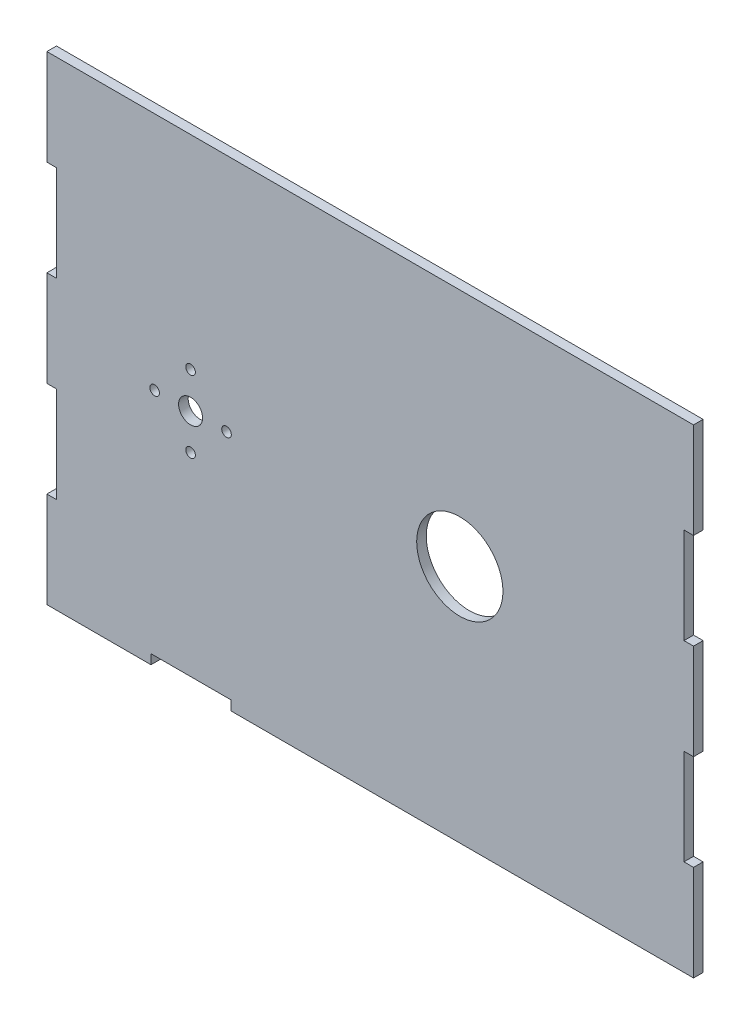
ISO-10303-21;
HEADER;
FILE_DESCRIPTION(('STEP AP214'),'2;1');
FILE_NAME('part.step','',(''),(''),'','','');
FILE_SCHEMA(('AUTOMOTIVE_DESIGN { 1 0 10303 214 1 1 1 1 }'));
ENDSEC;
DATA;
#1=APPLICATION_CONTEXT('core data for automotive mechanical design processes');
#2=APPLICATION_PROTOCOL_DEFINITION('international standard','automotive_design',2000,#1);
#3=PRODUCT_CONTEXT('',#1,'mechanical');
#4=PRODUCT('Part','Part','',(#3));
#5=PRODUCT_RELATED_PRODUCT_CATEGORY('part','',(#4));
#6=PRODUCT_DEFINITION_FORMATION('','',#4);
#7=PRODUCT_DEFINITION_CONTEXT('part definition',#1,'design');
#8=PRODUCT_DEFINITION('design','',#6,#7);
#9=PRODUCT_DEFINITION_SHAPE('','',#8);
#10=(LENGTH_UNIT() NAMED_UNIT(*) SI_UNIT(.MILLI.,.METRE.));
#11=(NAMED_UNIT(*) PLANE_ANGLE_UNIT() SI_UNIT($,.RADIAN.));
#12=(NAMED_UNIT(*) SI_UNIT($,.STERADIAN.) SOLID_ANGLE_UNIT());
#13=UNCERTAINTY_MEASURE_WITH_UNIT(LENGTH_MEASURE(1.E-05),#10,'distance_accuracy_value','');
#14=(GEOMETRIC_REPRESENTATION_CONTEXT(3) GLOBAL_UNCERTAINTY_ASSIGNED_CONTEXT((#13)) GLOBAL_UNIT_ASSIGNED_CONTEXT((#10,
#11,#12)) REPRESENTATION_CONTEXT('',''));
#15=CARTESIAN_POINT('',(0.,0.,0.));
#16=DIRECTION('',(0.,0.,1.));
#17=DIRECTION('',(1.,0.,0.));
#18=AXIS2_PLACEMENT_3D('',#15,#16,#17);
#19=CARTESIAN_POINT('',(0.,0.,2.54));
#20=DIRECTION('',(0.,1.,0.));
#21=DIRECTION('',(0.,0.,1.));
#22=AXIS2_PLACEMENT_3D('',#19,#20,#21);
#23=PLANE('',#22);
#24=DIRECTION('',(1.,0.,0.));
#25=VECTOR('',#24,1.);
#26=CARTESIAN_POINT('',(0.,0.,2.54));
#27=LINE('',#26,#25);
#28=CARTESIAN_POINT('',(48.768,0.,2.54));
#29=VERTEX_POINT('',#28);
#30=CARTESIAN_POINT('',(171.45,0.,2.54));
#31=VERTEX_POINT('',#30);
#32=EDGE_CURVE('E224',#29,#31,#27,.T.);
#33=ORIENTED_EDGE('',*,*,#32,.F.);
#34=DIRECTION('',(0.,0.,-1.));
#35=VECTOR('',#34,1.);
#36=CARTESIAN_POINT('',(48.768,0.,2.54));
#37=LINE('',#36,#35);
#38=CARTESIAN_POINT('',(48.768,0.,0.));
#39=VERTEX_POINT('',#38);
#40=EDGE_CURVE('E208',#29,#39,#37,.T.);
#41=ORIENTED_EDGE('',*,*,#40,.T.);
#42=DIRECTION('',(1.,0.,0.));
#43=VECTOR('',#42,1.);
#44=CARTESIAN_POINT('',(0.,0.,0.));
#45=LINE('',#44,#43);
#46=CARTESIAN_POINT('',(171.45,0.,0.));
#47=VERTEX_POINT('',#46);
#48=EDGE_CURVE('E260',#39,#47,#45,.T.);
#49=ORIENTED_EDGE('',*,*,#48,.T.);
#50=DIRECTION('',(0.,0.,-1.));
#51=VECTOR('',#50,1.);
#52=CARTESIAN_POINT('',(171.45,0.,2.54));
#53=LINE('',#52,#51);
#54=EDGE_CURVE('E54',#31,#47,#53,.T.);
#55=ORIENTED_EDGE('',*,*,#54,.F.);
#56=EDGE_LOOP('',(#33,#41,#49,#55));
#57=FACE_BOUND('',#56,.T.);
#58=ADVANCED_FACE('F45',(#57),#23,.F.);
#59=CARTESIAN_POINT('',(171.45,0.,2.54));
#60=DIRECTION('',(-1.,0.,0.));
#61=DIRECTION('',(0.,-1.,0.));
#62=AXIS2_PLACEMENT_3D('',#59,#60,#61);
#63=PLANE('',#62);
#64=DIRECTION('',(0.,1.,0.));
#65=VECTOR('',#64,1.);
#66=CARTESIAN_POINT('',(171.45,0.,0.));
#67=LINE('',#66,#65);
#68=CARTESIAN_POINT('',(171.45,25.4,0.));
#69=VERTEX_POINT('',#68);
#70=EDGE_CURVE('E268',#47,#69,#67,.T.);
#71=ORIENTED_EDGE('',*,*,#70,.T.);
#72=DIRECTION('',(0.,0.,1.));
#73=VECTOR('',#72,1.);
#74=CARTESIAN_POINT('',(171.45,25.4,0.));
#75=LINE('',#74,#73);
#76=CARTESIAN_POINT('',(171.45,25.4,2.54));
#77=VERTEX_POINT('',#76);
#78=EDGE_CURVE('E317',#69,#77,#75,.T.);
#79=ORIENTED_EDGE('',*,*,#78,.T.);
#80=DIRECTION('',(0.,1.,0.));
#81=VECTOR('',#80,1.);
#82=CARTESIAN_POINT('',(171.45,0.,2.54));
#83=LINE('',#82,#81);
#84=EDGE_CURVE('E248',#31,#77,#83,.T.);
#85=ORIENTED_EDGE('',*,*,#84,.F.);
#86=ORIENTED_EDGE('',*,*,#54,.T.);
#87=EDGE_LOOP('',(#71,#79,#85,#86));
#88=FACE_BOUND('',#87,.T.);
#89=ADVANCED_FACE('F285',(#88),#63,.F.);
#90=CARTESIAN_POINT('',(171.45,50.8,2.54));
#91=VERTEX_POINT('',#90);
#92=CARTESIAN_POINT('',(171.45,76.2,2.54));
#93=VERTEX_POINT('',#92);
#94=EDGE_CURVE('E252',#91,#93,#83,.T.);
#95=ORIENTED_EDGE('',*,*,#94,.F.);
#96=DIRECTION('',(0.,0.,1.));
#97=VECTOR('',#96,1.);
#98=CARTESIAN_POINT('',(171.45,50.8,0.));
#99=LINE('',#98,#97);
#100=CARTESIAN_POINT('',(171.45,50.8,0.));
#101=VERTEX_POINT('',#100);
#102=EDGE_CURVE('E295',#101,#91,#99,.T.);
#103=ORIENTED_EDGE('',*,*,#102,.F.);
#104=CARTESIAN_POINT('',(171.45,76.2,0.));
#105=VERTEX_POINT('',#104);
#106=EDGE_CURVE('E273',#101,#105,#67,.T.);
#107=ORIENTED_EDGE('',*,*,#106,.T.);
#108=DIRECTION('',(0.,0.,1.));
#109=VECTOR('',#108,1.);
#110=CARTESIAN_POINT('',(171.45,76.2,0.));
#111=LINE('',#110,#109);
#112=EDGE_CURVE('E350',#105,#93,#111,.T.);
#113=ORIENTED_EDGE('',*,*,#112,.T.);
#114=EDGE_LOOP('',(#95,#103,#107,#113));
#115=FACE_BOUND('',#114,.T.);
#116=ADVANCED_FACE('F486',(#115),#63,.F.);
#117=CARTESIAN_POINT('',(0.,0.,2.54));
#118=DIRECTION('',(1.,0.,0.));
#119=DIRECTION('',(0.,1.,0.));
#120=AXIS2_PLACEMENT_3D('',#117,#118,#119);
#121=PLANE('',#120);
#122=DIRECTION('',(0.,-1.,0.));
#123=VECTOR('',#122,1.);
#124=CARTESIAN_POINT('',(0.,0.,0.));
#125=LINE('',#124,#123);
#126=CARTESIAN_POINT('',(0.,76.2,0.));
#127=VERTEX_POINT('',#126);
#128=CARTESIAN_POINT('',(0.,50.8,0.));
#129=VERTEX_POINT('',#128);
#130=EDGE_CURVE('E261',#127,#129,#125,.T.);
#131=ORIENTED_EDGE('',*,*,#130,.T.);
#132=DIRECTION('',(0.,0.,1.));
#133=VECTOR('',#132,1.);
#134=CARTESIAN_POINT('',(0.,50.8,0.));
#135=LINE('',#134,#133);
#136=CARTESIAN_POINT('',(0.,50.8,2.54));
#137=VERTEX_POINT('',#136);
#138=EDGE_CURVE('E386',#129,#137,#135,.T.);
#139=ORIENTED_EDGE('',*,*,#138,.T.);
#140=DIRECTION('',(0.,-1.,0.));
#141=VECTOR('',#140,1.);
#142=CARTESIAN_POINT('',(0.,0.,2.54));
#143=LINE('',#142,#141);
#144=CARTESIAN_POINT('',(0.,76.2,2.54));
#145=VERTEX_POINT('',#144);
#146=EDGE_CURVE('E243',#145,#137,#143,.T.);
#147=ORIENTED_EDGE('',*,*,#146,.F.);
#148=DIRECTION('',(0.,0.,1.));
#149=VECTOR('',#148,1.);
#150=CARTESIAN_POINT('',(0.,76.2,0.));
#151=LINE('',#150,#149);
#152=EDGE_CURVE('E412',#127,#145,#151,.T.);
#153=ORIENTED_EDGE('',*,*,#152,.F.);
#154=EDGE_LOOP('',(#131,#139,#147,#153));
#155=FACE_BOUND('',#154,.T.);
#156=ADVANCED_FACE('F445',(#155),#121,.F.);
#157=CARTESIAN_POINT('',(0.,127.,0.));
#158=VERTEX_POINT('',#157);
#159=CARTESIAN_POINT('',(0.,101.6,0.));
#160=VERTEX_POINT('',#159);
#161=EDGE_CURVE('E256',#158,#160,#125,.T.);
#162=ORIENTED_EDGE('',*,*,#161,.T.);
#163=DIRECTION('',(0.,0.,1.));
#164=VECTOR('',#163,1.);
#165=CARTESIAN_POINT('',(0.,101.6,0.));
#166=LINE('',#165,#164);
#167=CARTESIAN_POINT('',(0.,101.6,2.54));
#168=VERTEX_POINT('',#167);
#169=EDGE_CURVE('E422',#160,#168,#166,.T.);
#170=ORIENTED_EDGE('',*,*,#169,.T.);
#171=CARTESIAN_POINT('',(0.,127.,2.54));
#172=VERTEX_POINT('',#171);
#173=EDGE_CURVE('E236',#172,#168,#143,.T.);
#174=ORIENTED_EDGE('',*,*,#173,.F.);
#175=DIRECTION('',(0.,0.,-1.));
#176=VECTOR('',#175,1.);
#177=CARTESIAN_POINT('',(0.,127.,2.54));
#178=LINE('',#177,#176);
#179=EDGE_CURVE('E255',#172,#158,#178,.T.);
#180=ORIENTED_EDGE('',*,*,#179,.T.);
#181=EDGE_LOOP('',(#162,#170,#174,#180));
#182=FACE_BOUND('',#181,.T.);
#183=ADVANCED_FACE('F507',(#182),#121,.F.);
#184=CARTESIAN_POINT('',(0.,25.4,2.54));
#185=VERTEX_POINT('',#184);
#186=CARTESIAN_POINT('',(0.,0.,2.54));
#187=VERTEX_POINT('',#186);
#188=EDGE_CURVE('E245',#185,#187,#143,.T.);
#189=ORIENTED_EDGE('',*,*,#188,.F.);
#190=DIRECTION('',(0.,0.,1.));
#191=VECTOR('',#190,1.);
#192=CARTESIAN_POINT('',(0.,25.4,0.));
#193=LINE('',#192,#191);
#194=CARTESIAN_POINT('',(0.,25.4,0.));
#195=VERTEX_POINT('',#194);
#196=EDGE_CURVE('E376',#195,#185,#193,.T.);
#197=ORIENTED_EDGE('',*,*,#196,.F.);
#198=CARTESIAN_POINT('',(0.,0.,0.));
#199=VERTEX_POINT('',#198);
#200=EDGE_CURVE('E262',#195,#199,#125,.T.);
#201=ORIENTED_EDGE('',*,*,#200,.T.);
#202=DIRECTION('',(0.,0.,-1.));
#203=VECTOR('',#202,1.);
#204=CARTESIAN_POINT('',(0.,0.,2.54));
#205=LINE('',#204,#203);
#206=EDGE_CURVE('E11',#187,#199,#205,.T.);
#207=ORIENTED_EDGE('',*,*,#206,.F.);
#208=EDGE_LOOP('',(#189,#197,#201,#207));
#209=FACE_BOUND('',#208,.T.);
#210=ADVANCED_FACE('F47',(#209),#121,.F.);
#211=CARTESIAN_POINT('',(27.6013333333333,0.,0.));
#212=VERTEX_POINT('',#211);
#213=EDGE_CURVE('E263',#199,#212,#45,.T.);
#214=ORIENTED_EDGE('',*,*,#213,.T.);
#215=DIRECTION('',(0.,0.,-1.));
#216=VECTOR('',#215,1.);
#217=CARTESIAN_POINT('',(27.6013333333333,0.,2.54));
#218=LINE('',#217,#216);
#219=CARTESIAN_POINT('',(27.6013333333333,0.,2.54));
#220=VERTEX_POINT('',#219);
#221=EDGE_CURVE('E61',#220,#212,#218,.T.);
#222=ORIENTED_EDGE('',*,*,#221,.F.);
#223=EDGE_CURVE('E235',#187,#220,#27,.T.);
#224=ORIENTED_EDGE('',*,*,#223,.F.);
#225=ORIENTED_EDGE('',*,*,#206,.T.);
#226=EDGE_LOOP('',(#214,#222,#224,#225));
#227=FACE_BOUND('',#226,.T.);
#228=ADVANCED_FACE('F456',(#227),#23,.F.);
#229=CARTESIAN_POINT('',(171.45,101.6,2.54));
#230=VERTEX_POINT('',#229);
#231=CARTESIAN_POINT('',(171.45,127.,2.54));
#232=VERTEX_POINT('',#231);
#233=EDGE_CURVE('E241',#230,#232,#83,.T.);
#234=ORIENTED_EDGE('',*,*,#233,.F.);
#235=DIRECTION('',(0.,0.,1.));
#236=VECTOR('',#235,1.);
#237=CARTESIAN_POINT('',(171.45,101.6,0.));
#238=LINE('',#237,#236);
#239=CARTESIAN_POINT('',(171.45,101.6,0.));
#240=VERTEX_POINT('',#239);
#241=EDGE_CURVE('E339',#240,#230,#238,.T.);
#242=ORIENTED_EDGE('',*,*,#241,.F.);
#243=CARTESIAN_POINT('',(171.45,127.,0.));
#244=VERTEX_POINT('',#243);
#245=EDGE_CURVE('E267',#240,#244,#67,.T.);
#246=ORIENTED_EDGE('',*,*,#245,.T.);
#247=DIRECTION('',(0.,0.,-1.));
#248=VECTOR('',#247,1.);
#249=CARTESIAN_POINT('',(171.45,127.,2.54));
#250=LINE('',#249,#248);
#251=EDGE_CURVE('E279',#232,#244,#250,.T.);
#252=ORIENTED_EDGE('',*,*,#251,.F.);
#253=EDGE_LOOP('',(#234,#242,#246,#252));
#254=FACE_BOUND('',#253,.T.);
#255=ADVANCED_FACE('F499',(#254),#63,.F.);
#256=CARTESIAN_POINT('',(0.,127.,2.54));
#257=DIRECTION('',(0.,-1.,0.));
#258=DIRECTION('',(0.,0.,-1.));
#259=AXIS2_PLACEMENT_3D('',#256,#257,#258);
#260=PLANE('',#259);
#261=DIRECTION('',(-1.,0.,0.));
#262=VECTOR('',#261,1.);
#263=CARTESIAN_POINT('',(0.,127.,0.));
#264=LINE('',#263,#262);
#265=EDGE_CURVE('E272',#244,#158,#264,.T.);
#266=ORIENTED_EDGE('',*,*,#265,.T.);
#267=ORIENTED_EDGE('',*,*,#179,.F.);
#268=DIRECTION('',(-1.,0.,0.));
#269=VECTOR('',#268,1.);
#270=CARTESIAN_POINT('',(0.,127.,2.54));
#271=LINE('',#270,#269);
#272=EDGE_CURVE('E251',#232,#172,#271,.T.);
#273=ORIENTED_EDGE('',*,*,#272,.F.);
#274=ORIENTED_EDGE('',*,*,#251,.T.);
#275=EDGE_LOOP('',(#266,#267,#273,#274));
#276=FACE_BOUND('',#275,.T.);
#277=ADVANCED_FACE('F503',(#276),#260,.F.);
#278=CARTESIAN_POINT('',(0.,0.,2.54));
#279=DIRECTION('',(0.,0.,-1.));
#280=DIRECTION('',(-1.,0.,0.));
#281=AXIS2_PLACEMENT_3D('',#278,#279,#280);
#282=PLANE('',#281);
#283=CARTESIAN_POINT('',(47.625,63.5,2.54));
#284=DIRECTION('',(0.,0.,-1.));
#285=DIRECTION('',(0.,1.,0.));
#286=AXIS2_PLACEMENT_3D('',#283,#284,#285);
#287=CIRCLE('',#286,1.27);
#288=CARTESIAN_POINT('',(47.625,64.77,2.54));
#289=VERTEX_POINT('',#288);
#290=EDGE_CURVE('E809',#289,#289,#287,.T.);
#291=ORIENTED_EDGE('',*,*,#290,.T.);
#292=EDGE_LOOP('',(#291));
#293=FACE_BOUND('',#292,.T.);
#294=CARTESIAN_POINT('',(38.1,53.975,2.54));
#295=DIRECTION('',(0.,0.,-1.));
#296=DIRECTION('',(1.,0.,0.));
#297=AXIS2_PLACEMENT_3D('',#294,#295,#296);
#298=CIRCLE('',#297,1.27);
#299=CARTESIAN_POINT('',(39.37,53.975,2.54));
#300=VERTEX_POINT('',#299);
#301=EDGE_CURVE('E814',#300,#300,#298,.T.);
#302=ORIENTED_EDGE('',*,*,#301,.T.);
#303=EDGE_LOOP('',(#302));
#304=FACE_BOUND('',#303,.T.);
#305=CARTESIAN_POINT('',(28.575,63.5000000000001,2.54));
#306=DIRECTION('',(0.,0.,-1.));
#307=DIRECTION('',(0.,-1.,0.));
#308=AXIS2_PLACEMENT_3D('',#305,#306,#307);
#309=CIRCLE('',#308,1.27);
#310=CARTESIAN_POINT('',(28.575,62.2300000000001,2.54));
#311=VERTEX_POINT('',#310);
#312=EDGE_CURVE('E827',#311,#311,#309,.T.);
#313=ORIENTED_EDGE('',*,*,#312,.T.);
#314=EDGE_LOOP('',(#313));
#315=FACE_BOUND('',#314,.T.);
#316=CARTESIAN_POINT('',(38.1,73.025,2.54));
#317=DIRECTION('',(0.,0.,-1.));
#318=DIRECTION('',(-1.,0.,0.));
#319=AXIS2_PLACEMENT_3D('',#316,#317,#318);
#320=CIRCLE('',#319,1.27);
#321=CARTESIAN_POINT('',(36.83,73.025,2.54));
#322=VERTEX_POINT('',#321);
#323=EDGE_CURVE('E835',#322,#322,#320,.T.);
#324=ORIENTED_EDGE('',*,*,#323,.T.);
#325=EDGE_LOOP('',(#324));
#326=FACE_BOUND('',#325,.T.);
#327=CARTESIAN_POINT('',(38.1,63.5,2.54));
#328=DIRECTION('',(0.,0.,-1.));
#329=DIRECTION('',(-1.,0.,0.));
#330=AXIS2_PLACEMENT_3D('',#327,#328,#329);
#331=CIRCLE('',#330,3.175);
#332=CARTESIAN_POINT('',(34.925,63.5,2.54));
#333=VERTEX_POINT('',#332);
#334=EDGE_CURVE('E843',#333,#333,#331,.T.);
#335=ORIENTED_EDGE('',*,*,#334,.T.);
#336=EDGE_LOOP('',(#335));
#337=FACE_BOUND('',#336,.T.);
#338=CARTESIAN_POINT('',(109.474,63.5,2.54));
#339=DIRECTION('',(0.,0.,-1.));
#340=DIRECTION('',(-1.,0.,0.));
#341=AXIS2_PLACEMENT_3D('',#338,#339,#340);
#342=CIRCLE('',#341,11.43);
#343=CARTESIAN_POINT('',(98.044,63.5,2.54));
#344=VERTEX_POINT('',#343);
#345=EDGE_CURVE('E468',#344,#344,#342,.T.);
#346=ORIENTED_EDGE('',*,*,#345,.T.);
#347=EDGE_LOOP('',(#346));
#348=FACE_BOUND('',#347,.T.);
#349=DIRECTION('',(1.,0.,0.));
#350=VECTOR('',#349,1.);
#351=CARTESIAN_POINT('',(48.768,2.54,2.54));
#352=LINE('',#351,#350);
#353=CARTESIAN_POINT('',(27.6013333333333,2.54,2.54));
#354=VERTEX_POINT('',#353);
#355=CARTESIAN_POINT('',(48.768,2.54,2.54));
#356=VERTEX_POINT('',#355);
#357=EDGE_CURVE('E219',#354,#356,#352,.T.);
#358=ORIENTED_EDGE('',*,*,#357,.T.);
#359=DIRECTION('',(0.,-1.,0.));
#360=VECTOR('',#359,1.);
#361=CARTESIAN_POINT('',(48.768,0.,2.54));
#362=LINE('',#361,#360);
#363=EDGE_CURVE('E211',#356,#29,#362,.T.);
#364=ORIENTED_EDGE('',*,*,#363,.T.);
#365=ORIENTED_EDGE('',*,*,#32,.T.);
#366=ORIENTED_EDGE('',*,*,#84,.T.);
#367=DIRECTION('',(1.,0.,0.));
#368=VECTOR('',#367,1.);
#369=CARTESIAN_POINT('',(171.45,25.4,2.54));
#370=LINE('',#369,#368);
#371=CARTESIAN_POINT('',(168.91,25.4,2.54));
#372=VERTEX_POINT('',#371);
#373=EDGE_CURVE('E314',#372,#77,#370,.T.);
#374=ORIENTED_EDGE('',*,*,#373,.F.);
#375=DIRECTION('',(0.,-1.,0.));
#376=VECTOR('',#375,1.);
#377=CARTESIAN_POINT('',(168.91,25.4,2.54));
#378=LINE('',#377,#376);
#379=CARTESIAN_POINT('',(168.91,50.8,2.54));
#380=VERTEX_POINT('',#379);
#381=EDGE_CURVE('E309',#380,#372,#378,.T.);
#382=ORIENTED_EDGE('',*,*,#381,.F.);
#383=DIRECTION('',(-1.,0.,0.));
#384=VECTOR('',#383,1.);
#385=CARTESIAN_POINT('',(171.45,50.8,2.54));
#386=LINE('',#385,#384);
#387=EDGE_CURVE('E305',#91,#380,#386,.T.);
#388=ORIENTED_EDGE('',*,*,#387,.F.);
#389=ORIENTED_EDGE('',*,*,#94,.T.);
#390=DIRECTION('',(1.,0.,0.));
#391=VECTOR('',#390,1.);
#392=CARTESIAN_POINT('',(171.45,76.2,2.54));
#393=LINE('',#392,#391);
#394=CARTESIAN_POINT('',(168.91,76.2,2.54));
#395=VERTEX_POINT('',#394);
#396=EDGE_CURVE('E331',#395,#93,#393,.T.);
#397=ORIENTED_EDGE('',*,*,#396,.F.);
#398=DIRECTION('',(0.,-1.,0.));
#399=VECTOR('',#398,1.);
#400=CARTESIAN_POINT('',(168.91,101.6,2.54));
#401=LINE('',#400,#399);
#402=CARTESIAN_POINT('',(168.91,101.6,2.54));
#403=VERTEX_POINT('',#402);
#404=EDGE_CURVE('E343',#403,#395,#401,.T.);
#405=ORIENTED_EDGE('',*,*,#404,.F.);
#406=DIRECTION('',(-1.,0.,0.));
#407=VECTOR('',#406,1.);
#408=CARTESIAN_POINT('',(171.45,101.6,2.54));
#409=LINE('',#408,#407);
#410=EDGE_CURVE('E320',#230,#403,#409,.T.);
#411=ORIENTED_EDGE('',*,*,#410,.F.);
#412=ORIENTED_EDGE('',*,*,#233,.T.);
#413=ORIENTED_EDGE('',*,*,#272,.T.);
#414=ORIENTED_EDGE('',*,*,#173,.T.);
#415=DIRECTION('',(-1.,0.,0.));
#416=VECTOR('',#415,1.);
#417=CARTESIAN_POINT('',(0.,101.6,2.54));
#418=LINE('',#417,#416);
#419=CARTESIAN_POINT('',(2.53999999999994,101.6,2.54));
#420=VERTEX_POINT('',#419);
#421=EDGE_CURVE('E404',#420,#168,#418,.T.);
#422=ORIENTED_EDGE('',*,*,#421,.F.);
#423=DIRECTION('',(0.,1.,0.));
#424=VECTOR('',#423,1.);
#425=CARTESIAN_POINT('',(2.53999999999994,101.6,2.54));
#426=LINE('',#425,#424);
#427=CARTESIAN_POINT('',(2.53999999999995,76.2,2.54));
#428=VERTEX_POINT('',#427);
#429=EDGE_CURVE('E416',#428,#420,#426,.T.);
#430=ORIENTED_EDGE('',*,*,#429,.F.);
#431=DIRECTION('',(1.,0.,0.));
#432=VECTOR('',#431,1.);
#433=CARTESIAN_POINT('',(0.,76.2,2.54));
#434=LINE('',#433,#432);
#435=EDGE_CURVE('E390',#145,#428,#434,.T.);
#436=ORIENTED_EDGE('',*,*,#435,.F.);
#437=ORIENTED_EDGE('',*,*,#146,.T.);
#438=DIRECTION('',(-1.,0.,0.));
#439=VECTOR('',#438,1.);
#440=CARTESIAN_POINT('',(0.,50.8,2.54));
#441=LINE('',#440,#439);
#442=CARTESIAN_POINT('',(2.53999999999995,50.8,2.54));
#443=VERTEX_POINT('',#442);
#444=EDGE_CURVE('E368',#443,#137,#441,.T.);
#445=ORIENTED_EDGE('',*,*,#444,.F.);
#446=DIRECTION('',(0.,1.,0.));
#447=VECTOR('',#446,1.);
#448=CARTESIAN_POINT('',(2.53999999999995,50.8,2.54));
#449=LINE('',#448,#447);
#450=CARTESIAN_POINT('',(2.53999999999995,25.4,2.54));
#451=VERTEX_POINT('',#450);
#452=EDGE_CURVE('E380',#451,#443,#449,.T.);
#453=ORIENTED_EDGE('',*,*,#452,.F.);
#454=DIRECTION('',(1.,0.,0.));
#455=VECTOR('',#454,1.);
#456=CARTESIAN_POINT('',(0.,25.4,2.54));
#457=LINE('',#456,#455);
#458=EDGE_CURVE('E354',#185,#451,#457,.T.);
#459=ORIENTED_EDGE('',*,*,#458,.F.);
#460=ORIENTED_EDGE('',*,*,#188,.T.);
#461=ORIENTED_EDGE('',*,*,#223,.T.);
#462=DIRECTION('',(0.,1.,0.));
#463=VECTOR('',#462,1.);
#464=CARTESIAN_POINT('',(27.6013333333333,0.,2.54));
#465=LINE('',#464,#463);
#466=EDGE_CURVE('E229',#220,#354,#465,.T.);
#467=ORIENTED_EDGE('',*,*,#466,.T.);
#468=EDGE_LOOP('',(#358,#364,#365,#366,#374,#382,#388,#389,#397,#405,#411,#412,#413,#414,#422,
#430,#436,#437,#445,#453,#459,#460,#461,#467));
#469=FACE_BOUND('',#468,.T.);
#470=ADVANCED_FACE('F222',(#293,#304,#315,#326,#337,#348,#469),#282,.F.);
#471=CARTESIAN_POINT('',(0.,0.,0.));
#472=DIRECTION('',(0.,0.,-1.));
#473=DIRECTION('',(-1.,0.,0.));
#474=AXIS2_PLACEMENT_3D('',#471,#472,#473);
#475=PLANE('',#474);
#476=CARTESIAN_POINT('',(47.625,63.5,0.));
#477=DIRECTION('',(0.,0.,-1.));
#478=DIRECTION('',(0.,1.,0.));
#479=AXIS2_PLACEMENT_3D('',#476,#477,#478);
#480=CIRCLE('',#479,1.27);
#481=CARTESIAN_POINT('',(47.625,64.77,0.));
#482=VERTEX_POINT('',#481);
#483=EDGE_CURVE('E812',#482,#482,#480,.T.);
#484=ORIENTED_EDGE('',*,*,#483,.F.);
#485=EDGE_LOOP('',(#484));
#486=FACE_BOUND('',#485,.T.);
#487=CARTESIAN_POINT('',(38.1,53.975,0.));
#488=DIRECTION('',(0.,0.,-1.));
#489=DIRECTION('',(1.,0.,0.));
#490=AXIS2_PLACEMENT_3D('',#487,#488,#489);
#491=CIRCLE('',#490,1.27);
#492=CARTESIAN_POINT('',(39.37,53.975,0.));
#493=VERTEX_POINT('',#492);
#494=EDGE_CURVE('E821',#493,#493,#491,.T.);
#495=ORIENTED_EDGE('',*,*,#494,.F.);
#496=EDGE_LOOP('',(#495));
#497=FACE_BOUND('',#496,.T.);
#498=CARTESIAN_POINT('',(28.575,63.5000000000001,0.));
#499=DIRECTION('',(0.,0.,-1.));
#500=DIRECTION('',(0.,-1.,0.));
#501=AXIS2_PLACEMENT_3D('',#498,#499,#500);
#502=CIRCLE('',#501,1.27);
#503=CARTESIAN_POINT('',(28.575,62.2300000000001,0.));
#504=VERTEX_POINT('',#503);
#505=EDGE_CURVE('E831',#504,#504,#502,.T.);
#506=ORIENTED_EDGE('',*,*,#505,.F.);
#507=EDGE_LOOP('',(#506));
#508=FACE_BOUND('',#507,.T.);
#509=CARTESIAN_POINT('',(38.1,73.025,0.));
#510=DIRECTION('',(0.,0.,-1.));
#511=DIRECTION('',(-1.,0.,0.));
#512=AXIS2_PLACEMENT_3D('',#509,#510,#511);
#513=CIRCLE('',#512,1.27);
#514=CARTESIAN_POINT('',(36.83,73.025,0.));
#515=VERTEX_POINT('',#514);
#516=EDGE_CURVE('E818',#515,#515,#513,.T.);
#517=ORIENTED_EDGE('',*,*,#516,.F.);
#518=EDGE_LOOP('',(#517));
#519=FACE_BOUND('',#518,.T.);
#520=CARTESIAN_POINT('',(38.1,63.5,0.));
#521=DIRECTION('',(0.,0.,-1.));
#522=DIRECTION('',(-1.,0.,0.));
#523=AXIS2_PLACEMENT_3D('',#520,#521,#522);
#524=CIRCLE('',#523,3.175);
#525=CARTESIAN_POINT('',(34.925,63.5,0.));
#526=VERTEX_POINT('',#525);
#527=EDGE_CURVE('E839',#526,#526,#524,.T.);
#528=ORIENTED_EDGE('',*,*,#527,.F.);
#529=EDGE_LOOP('',(#528));
#530=FACE_BOUND('',#529,.T.);
#531=CARTESIAN_POINT('',(109.474,63.5,0.));
#532=DIRECTION('',(0.,0.,-1.));
#533=DIRECTION('',(-1.,0.,0.));
#534=AXIS2_PLACEMENT_3D('',#531,#532,#533);
#535=CIRCLE('',#534,11.43);
#536=CARTESIAN_POINT('',(98.044,63.5,0.));
#537=VERTEX_POINT('',#536);
#538=EDGE_CURVE('E847',#537,#537,#535,.T.);
#539=ORIENTED_EDGE('',*,*,#538,.F.);
#540=EDGE_LOOP('',(#539));
#541=FACE_BOUND('',#540,.T.);
#542=DIRECTION('',(0.,-1.,0.));
#543=VECTOR('',#542,1.);
#544=CARTESIAN_POINT('',(48.768,0.,0.));
#545=LINE('',#544,#543);
#546=CARTESIAN_POINT('',(48.768,2.54,0.));
#547=VERTEX_POINT('',#546);
#548=EDGE_CURVE('E214',#547,#39,#545,.T.);
#549=ORIENTED_EDGE('',*,*,#548,.F.);
#550=DIRECTION('',(1.,0.,0.));
#551=VECTOR('',#550,1.);
#552=CARTESIAN_POINT('',(48.768,2.54,0.));
#553=LINE('',#552,#551);
#554=CARTESIAN_POINT('',(27.6013333333333,2.54,0.));
#555=VERTEX_POINT('',#554);
#556=EDGE_CURVE('E230',#555,#547,#553,.T.);
#557=ORIENTED_EDGE('',*,*,#556,.F.);
#558=DIRECTION('',(0.,1.,0.));
#559=VECTOR('',#558,1.);
#560=CARTESIAN_POINT('',(27.6013333333333,0.,0.));
#561=LINE('',#560,#559);
#562=EDGE_CURVE('E461',#212,#555,#561,.T.);
#563=ORIENTED_EDGE('',*,*,#562,.F.);
#564=ORIENTED_EDGE('',*,*,#213,.F.);
#565=ORIENTED_EDGE('',*,*,#200,.F.);
#566=DIRECTION('',(1.,0.,0.));
#567=VECTOR('',#566,1.);
#568=CARTESIAN_POINT('',(0.,25.4,0.));
#569=LINE('',#568,#567);
#570=CARTESIAN_POINT('',(2.53999999999995,25.4,0.));
#571=VERTEX_POINT('',#570);
#572=EDGE_CURVE('E363',#195,#571,#569,.T.);
#573=ORIENTED_EDGE('',*,*,#572,.T.);
#574=DIRECTION('',(0.,1.,0.));
#575=VECTOR('',#574,1.);
#576=CARTESIAN_POINT('',(2.53999999999995,50.8,0.));
#577=LINE('',#576,#575);
#578=CARTESIAN_POINT('',(2.53999999999995,50.8,0.));
#579=VERTEX_POINT('',#578);
#580=EDGE_CURVE('E367',#571,#579,#577,.T.);
#581=ORIENTED_EDGE('',*,*,#580,.T.);
#582=DIRECTION('',(-1.,0.,0.));
#583=VECTOR('',#582,1.);
#584=CARTESIAN_POINT('',(0.,50.8,0.));
#585=LINE('',#584,#583);
#586=EDGE_CURVE('E372',#579,#129,#585,.T.);
#587=ORIENTED_EDGE('',*,*,#586,.T.);
#588=ORIENTED_EDGE('',*,*,#130,.F.);
#589=DIRECTION('',(1.,0.,0.));
#590=VECTOR('',#589,1.);
#591=CARTESIAN_POINT('',(0.,76.2,0.));
#592=LINE('',#591,#590);
#593=CARTESIAN_POINT('',(2.53999999999995,76.2,0.));
#594=VERTEX_POINT('',#593);
#595=EDGE_CURVE('E399',#127,#594,#592,.T.);
#596=ORIENTED_EDGE('',*,*,#595,.T.);
#597=DIRECTION('',(0.,1.,0.));
#598=VECTOR('',#597,1.);
#599=CARTESIAN_POINT('',(2.53999999999994,101.6,0.));
#600=LINE('',#599,#598);
#601=CARTESIAN_POINT('',(2.53999999999994,101.6,0.));
#602=VERTEX_POINT('',#601);
#603=EDGE_CURVE('E403',#594,#602,#600,.T.);
#604=ORIENTED_EDGE('',*,*,#603,.T.);
#605=DIRECTION('',(-1.,0.,0.));
#606=VECTOR('',#605,1.);
#607=CARTESIAN_POINT('',(0.,101.6,0.));
#608=LINE('',#607,#606);
#609=EDGE_CURVE('E408',#602,#160,#608,.T.);
#610=ORIENTED_EDGE('',*,*,#609,.T.);
#611=ORIENTED_EDGE('',*,*,#161,.F.);
#612=ORIENTED_EDGE('',*,*,#265,.F.);
#613=ORIENTED_EDGE('',*,*,#245,.F.);
#614=DIRECTION('',(-1.,0.,0.));
#615=VECTOR('',#614,1.);
#616=CARTESIAN_POINT('',(171.45,101.6,0.));
#617=LINE('',#616,#615);
#618=CARTESIAN_POINT('',(168.91,101.6,0.));
#619=VERTEX_POINT('',#618);
#620=EDGE_CURVE('E326',#240,#619,#617,.T.);
#621=ORIENTED_EDGE('',*,*,#620,.T.);
#622=DIRECTION('',(0.,-1.,0.));
#623=VECTOR('',#622,1.);
#624=CARTESIAN_POINT('',(168.91,101.6,0.));
#625=LINE('',#624,#623);
#626=CARTESIAN_POINT('',(168.91,76.2,0.));
#627=VERTEX_POINT('',#626);
#628=EDGE_CURVE('E330',#619,#627,#625,.T.);
#629=ORIENTED_EDGE('',*,*,#628,.T.);
#630=DIRECTION('',(1.,0.,0.));
#631=VECTOR('',#630,1.);
#632=CARTESIAN_POINT('',(171.45,76.2,0.));
#633=LINE('',#632,#631);
#634=EDGE_CURVE('E335',#627,#105,#633,.T.);
#635=ORIENTED_EDGE('',*,*,#634,.T.);
#636=ORIENTED_EDGE('',*,*,#106,.F.);
#637=DIRECTION('',(-1.,0.,0.));
#638=VECTOR('',#637,1.);
#639=CARTESIAN_POINT('',(171.45,50.8,0.));
#640=LINE('',#639,#638);
#641=CARTESIAN_POINT('',(168.91,50.8,0.));
#642=VERTEX_POINT('',#641);
#643=EDGE_CURVE('E301',#101,#642,#640,.T.);
#644=ORIENTED_EDGE('',*,*,#643,.T.);
#645=DIRECTION('',(0.,-1.,0.));
#646=VECTOR('',#645,1.);
#647=CARTESIAN_POINT('',(168.91,25.4,0.));
#648=LINE('',#647,#646);
#649=CARTESIAN_POINT('',(168.91,25.4,0.));
#650=VERTEX_POINT('',#649);
#651=EDGE_CURVE('E69',#642,#650,#648,.T.);
#652=ORIENTED_EDGE('',*,*,#651,.T.);
#653=DIRECTION('',(1.,0.,0.));
#654=VECTOR('',#653,1.);
#655=CARTESIAN_POINT('',(171.45,25.4,0.));
#656=LINE('',#655,#654);
#657=EDGE_CURVE('E291',#650,#69,#656,.T.);
#658=ORIENTED_EDGE('',*,*,#657,.T.);
#659=ORIENTED_EDGE('',*,*,#70,.F.);
#660=ORIENTED_EDGE('',*,*,#48,.F.);
#661=EDGE_LOOP('',(#549,#557,#563,#564,#565,#573,#581,#587,#588,#596,#604,#610,#611,#612,#613,
#621,#629,#635,#636,#644,#652,#658,#659,#660));
#662=FACE_BOUND('',#661,.T.);
#663=ADVANCED_FACE('F289',(#486,#497,#508,#519,#530,#541,#662),#475,.T.);
#664=CARTESIAN_POINT('',(0.,101.6,0.));
#665=DIRECTION('',(0.,1.,0.));
#666=DIRECTION('',(0.,0.,1.));
#667=AXIS2_PLACEMENT_3D('',#664,#665,#666);
#668=PLANE('',#667);
#669=ORIENTED_EDGE('',*,*,#421,.T.);
#670=ORIENTED_EDGE('',*,*,#169,.F.);
#671=ORIENTED_EDGE('',*,*,#609,.F.);
#672=DIRECTION('',(0.,0.,1.));
#673=VECTOR('',#672,1.);
#674=CARTESIAN_POINT('',(2.53999999999994,101.6,0.));
#675=LINE('',#674,#673);
#676=EDGE_CURVE('E426',#602,#420,#675,.T.);
#677=ORIENTED_EDGE('',*,*,#676,.T.);
#678=EDGE_LOOP('',(#669,#670,#671,#677));
#679=FACE_BOUND('',#678,.T.);
#680=ADVANCED_FACE('F509',(#679),#668,.F.);
#681=CARTESIAN_POINT('',(2.53999999999994,101.6,0.));
#682=DIRECTION('',(1.,0.,0.));
#683=DIRECTION('',(0.,1.,0.));
#684=AXIS2_PLACEMENT_3D('',#681,#682,#683);
#685=PLANE('',#684);
#686=ORIENTED_EDGE('',*,*,#429,.T.);
#687=ORIENTED_EDGE('',*,*,#676,.F.);
#688=ORIENTED_EDGE('',*,*,#603,.F.);
#689=DIRECTION('',(0.,0.,1.));
#690=VECTOR('',#689,1.);
#691=CARTESIAN_POINT('',(2.53999999999995,76.2,0.));
#692=LINE('',#691,#690);
#693=EDGE_CURVE('E429',#594,#428,#692,.T.);
#694=ORIENTED_EDGE('',*,*,#693,.T.);
#695=EDGE_LOOP('',(#686,#687,#688,#694));
#696=FACE_BOUND('',#695,.T.);
#697=ADVANCED_FACE('F512',(#696),#685,.F.);
#698=CARTESIAN_POINT('',(0.,76.2,0.));
#699=DIRECTION('',(0.,-1.,0.));
#700=DIRECTION('',(0.,0.,-1.));
#701=AXIS2_PLACEMENT_3D('',#698,#699,#700);
#702=PLANE('',#701);
#703=ORIENTED_EDGE('',*,*,#435,.T.);
#704=ORIENTED_EDGE('',*,*,#693,.F.);
#705=ORIENTED_EDGE('',*,*,#595,.F.);
#706=ORIENTED_EDGE('',*,*,#152,.T.);
#707=EDGE_LOOP('',(#703,#704,#705,#706));
#708=FACE_BOUND('',#707,.T.);
#709=ADVANCED_FACE('F435',(#708),#702,.F.);
#710=CARTESIAN_POINT('',(0.,50.8,0.));
#711=DIRECTION('',(0.,1.,0.));
#712=DIRECTION('',(0.,0.,1.));
#713=AXIS2_PLACEMENT_3D('',#710,#711,#712);
#714=PLANE('',#713);
#715=ORIENTED_EDGE('',*,*,#444,.T.);
#716=ORIENTED_EDGE('',*,*,#138,.F.);
#717=ORIENTED_EDGE('',*,*,#586,.F.);
#718=DIRECTION('',(0.,0.,1.));
#719=VECTOR('',#718,1.);
#720=CARTESIAN_POINT('',(2.53999999999995,50.8,0.));
#721=LINE('',#720,#719);
#722=EDGE_CURVE('E391',#579,#443,#721,.T.);
#723=ORIENTED_EDGE('',*,*,#722,.T.);
#724=EDGE_LOOP('',(#715,#716,#717,#723));
#725=FACE_BOUND('',#724,.T.);
#726=ADVANCED_FACE('F519',(#725),#714,.F.);
#727=CARTESIAN_POINT('',(2.53999999999995,50.8,0.));
#728=DIRECTION('',(1.,0.,0.));
#729=DIRECTION('',(0.,1.,0.));
#730=AXIS2_PLACEMENT_3D('',#727,#728,#729);
#731=PLANE('',#730);
#732=ORIENTED_EDGE('',*,*,#452,.T.);
#733=ORIENTED_EDGE('',*,*,#722,.F.);
#734=ORIENTED_EDGE('',*,*,#580,.F.);
#735=DIRECTION('',(0.,0.,1.));
#736=VECTOR('',#735,1.);
#737=CARTESIAN_POINT('',(2.53999999999995,25.4,0.));
#738=LINE('',#737,#736);
#739=EDGE_CURVE('E394',#571,#451,#738,.T.);
#740=ORIENTED_EDGE('',*,*,#739,.T.);
#741=EDGE_LOOP('',(#732,#733,#734,#740));
#742=FACE_BOUND('',#741,.T.);
#743=ADVANCED_FACE('F521',(#742),#731,.F.);
#744=CARTESIAN_POINT('',(0.,25.4,0.));
#745=DIRECTION('',(0.,-1.,0.));
#746=DIRECTION('',(0.,0.,-1.));
#747=AXIS2_PLACEMENT_3D('',#744,#745,#746);
#748=PLANE('',#747);
#749=ORIENTED_EDGE('',*,*,#458,.T.);
#750=ORIENTED_EDGE('',*,*,#739,.F.);
#751=ORIENTED_EDGE('',*,*,#572,.F.);
#752=ORIENTED_EDGE('',*,*,#196,.T.);
#753=EDGE_LOOP('',(#749,#750,#751,#752));
#754=FACE_BOUND('',#753,.T.);
#755=ADVANCED_FACE('F524',(#754),#748,.F.);
#756=CARTESIAN_POINT('',(171.45,76.2,0.));
#757=DIRECTION('',(0.,-1.,0.));
#758=DIRECTION('',(1.,0.,0.));
#759=AXIS2_PLACEMENT_3D('',#756,#757,#758);
#760=PLANE('',#759);
#761=ORIENTED_EDGE('',*,*,#396,.T.);
#762=ORIENTED_EDGE('',*,*,#112,.F.);
#763=ORIENTED_EDGE('',*,*,#634,.F.);
#764=DIRECTION('',(0.,0.,1.));
#765=VECTOR('',#764,1.);
#766=CARTESIAN_POINT('',(168.91,76.2,0.));
#767=LINE('',#766,#765);
#768=EDGE_CURVE('E355',#627,#395,#767,.T.);
#769=ORIENTED_EDGE('',*,*,#768,.T.);
#770=EDGE_LOOP('',(#761,#762,#763,#769));
#771=FACE_BOUND('',#770,.T.);
#772=ADVANCED_FACE('F526',(#771),#760,.F.);
#773=CARTESIAN_POINT('',(168.91,101.6,0.));
#774=DIRECTION('',(-1.,0.,0.));
#775=DIRECTION('',(0.,0.,1.));
#776=AXIS2_PLACEMENT_3D('',#773,#774,#775);
#777=PLANE('',#776);
#778=ORIENTED_EDGE('',*,*,#404,.T.);
#779=ORIENTED_EDGE('',*,*,#768,.F.);
#780=ORIENTED_EDGE('',*,*,#628,.F.);
#781=DIRECTION('',(0.,0.,1.));
#782=VECTOR('',#781,1.);
#783=CARTESIAN_POINT('',(168.91,101.6,0.));
#784=LINE('',#783,#782);
#785=EDGE_CURVE('E358',#619,#403,#784,.T.);
#786=ORIENTED_EDGE('',*,*,#785,.T.);
#787=EDGE_LOOP('',(#778,#779,#780,#786));
#788=FACE_BOUND('',#787,.T.);
#789=ADVANCED_FACE('F532',(#788),#777,.F.);
#790=CARTESIAN_POINT('',(171.45,101.6,0.));
#791=DIRECTION('',(0.,1.,0.));
#792=DIRECTION('',(0.,0.,1.));
#793=AXIS2_PLACEMENT_3D('',#790,#791,#792);
#794=PLANE('',#793);
#795=ORIENTED_EDGE('',*,*,#410,.T.);
#796=ORIENTED_EDGE('',*,*,#785,.F.);
#797=ORIENTED_EDGE('',*,*,#620,.F.);
#798=ORIENTED_EDGE('',*,*,#241,.T.);
#799=EDGE_LOOP('',(#795,#796,#797,#798));
#800=FACE_BOUND('',#799,.T.);
#801=ADVANCED_FACE('F624',(#800),#794,.F.);
#802=CARTESIAN_POINT('',(171.45,25.4,0.));
#803=DIRECTION('',(0.,-1.,0.));
#804=DIRECTION('',(0.,0.,-1.));
#805=AXIS2_PLACEMENT_3D('',#802,#803,#804);
#806=PLANE('',#805);
#807=ORIENTED_EDGE('',*,*,#373,.T.);
#808=ORIENTED_EDGE('',*,*,#78,.F.);
#809=ORIENTED_EDGE('',*,*,#657,.F.);
#810=DIRECTION('',(0.,0.,1.));
#811=VECTOR('',#810,1.);
#812=CARTESIAN_POINT('',(168.91,25.4,0.));
#813=LINE('',#812,#811);
#814=EDGE_CURVE('E321',#650,#372,#813,.T.);
#815=ORIENTED_EDGE('',*,*,#814,.T.);
#816=EDGE_LOOP('',(#807,#808,#809,#815));
#817=FACE_BOUND('',#816,.T.);
#818=ADVANCED_FACE('F635',(#817),#806,.F.);
#819=CARTESIAN_POINT('',(168.91,25.4,0.));
#820=DIRECTION('',(-1.,0.,0.));
#821=DIRECTION('',(0.,0.,1.));
#822=AXIS2_PLACEMENT_3D('',#819,#820,#821);
#823=PLANE('',#822);
#824=ORIENTED_EDGE('',*,*,#381,.T.);
#825=ORIENTED_EDGE('',*,*,#814,.F.);
#826=ORIENTED_EDGE('',*,*,#651,.F.);
#827=DIRECTION('',(0.,0.,1.));
#828=VECTOR('',#827,1.);
#829=CARTESIAN_POINT('',(168.91,50.8,0.));
#830=LINE('',#829,#828);
#831=EDGE_CURVE('E299',#642,#380,#830,.T.);
#832=ORIENTED_EDGE('',*,*,#831,.T.);
#833=EDGE_LOOP('',(#824,#825,#826,#832));
#834=FACE_BOUND('',#833,.T.);
#835=ADVANCED_FACE('F656',(#834),#823,.F.);
#836=CARTESIAN_POINT('',(171.45,50.8,0.));
#837=DIRECTION('',(0.,1.,0.));
#838=DIRECTION('',(0.,0.,1.));
#839=AXIS2_PLACEMENT_3D('',#836,#837,#838);
#840=PLANE('',#839);
#841=ORIENTED_EDGE('',*,*,#387,.T.);
#842=ORIENTED_EDGE('',*,*,#831,.F.);
#843=ORIENTED_EDGE('',*,*,#643,.F.);
#844=ORIENTED_EDGE('',*,*,#102,.T.);
#845=EDGE_LOOP('',(#841,#842,#843,#844));
#846=FACE_BOUND('',#845,.T.);
#847=ADVANCED_FACE('F482',(#846),#840,.F.);
#848=CARTESIAN_POINT('',(48.768,0.,2.54));
#849=DIRECTION('',(1.,0.,0.));
#850=DIRECTION('',(0.,0.,-1.));
#851=AXIS2_PLACEMENT_3D('',#848,#849,#850);
#852=PLANE('',#851);
#853=ORIENTED_EDGE('',*,*,#548,.T.);
#854=ORIENTED_EDGE('',*,*,#40,.F.);
#855=ORIENTED_EDGE('',*,*,#363,.F.);
#856=DIRECTION('',(0.,0.,-1.));
#857=VECTOR('',#856,1.);
#858=CARTESIAN_POINT('',(48.768,2.54,2.54));
#859=LINE('',#858,#857);
#860=EDGE_CURVE('E310',#356,#547,#859,.T.);
#861=ORIENTED_EDGE('',*,*,#860,.T.);
#862=EDGE_LOOP('',(#853,#854,#855,#861));
#863=FACE_BOUND('',#862,.T.);
#864=ADVANCED_FACE('F210',(#863),#852,.F.);
#865=CARTESIAN_POINT('',(48.768,2.54,2.54));
#866=DIRECTION('',(0.,1.,0.));
#867=DIRECTION('',(0.,0.,1.));
#868=AXIS2_PLACEMENT_3D('',#865,#866,#867);
#869=PLANE('',#868);
#870=ORIENTED_EDGE('',*,*,#556,.T.);
#871=ORIENTED_EDGE('',*,*,#860,.F.);
#872=ORIENTED_EDGE('',*,*,#357,.F.);
#873=DIRECTION('',(0.,0.,-1.));
#874=VECTOR('',#873,1.);
#875=CARTESIAN_POINT('',(27.6013333333333,2.54,2.54));
#876=LINE('',#875,#874);
#877=EDGE_CURVE('E474',#354,#555,#876,.T.);
#878=ORIENTED_EDGE('',*,*,#877,.T.);
#879=EDGE_LOOP('',(#870,#871,#872,#878));
#880=FACE_BOUND('',#879,.T.);
#881=ADVANCED_FACE('F694',(#880),#869,.F.);
#882=CARTESIAN_POINT('',(27.6013333333333,0.,2.54));
#883=DIRECTION('',(-1.,0.,0.));
#884=DIRECTION('',(0.,0.,1.));
#885=AXIS2_PLACEMENT_3D('',#882,#883,#884);
#886=PLANE('',#885);
#887=ORIENTED_EDGE('',*,*,#562,.T.);
#888=ORIENTED_EDGE('',*,*,#877,.F.);
#889=ORIENTED_EDGE('',*,*,#466,.F.);
#890=ORIENTED_EDGE('',*,*,#221,.T.);
#891=EDGE_LOOP('',(#887,#888,#889,#890));
#892=FACE_BOUND('',#891,.T.);
#893=ADVANCED_FACE('F703',(#892),#886,.F.);
#894=CARTESIAN_POINT('',(109.474,63.5,2.54));
#895=DIRECTION('',(0.,0.,-1.));
#896=DIRECTION('',(-1.,0.,0.));
#897=AXIS2_PLACEMENT_3D('',#894,#895,#896);
#898=CYLINDRICAL_SURFACE('',#897,11.43);
#899=ORIENTED_EDGE('',*,*,#345,.F.);
#900=EDGE_LOOP('',(#899));
#901=FACE_BOUND('',#900,.T.);
#902=ORIENTED_EDGE('',*,*,#538,.T.);
#903=EDGE_LOOP('',(#902));
#904=FACE_BOUND('',#903,.T.);
#905=ADVANCED_FACE('F714',(#901,#904),#898,.F.);
#906=CARTESIAN_POINT('',(38.1,63.5,2.54));
#907=DIRECTION('',(0.,0.,-1.));
#908=DIRECTION('',(-1.,0.,0.));
#909=AXIS2_PLACEMENT_3D('',#906,#907,#908);
#910=CYLINDRICAL_SURFACE('',#909,3.175);
#911=ORIENTED_EDGE('',*,*,#334,.F.);
#912=EDGE_LOOP('',(#911));
#913=FACE_BOUND('',#912,.T.);
#914=ORIENTED_EDGE('',*,*,#527,.T.);
#915=EDGE_LOOP('',(#914));
#916=FACE_BOUND('',#915,.T.);
#917=ADVANCED_FACE('F724',(#913,#916),#910,.F.);
#918=CARTESIAN_POINT('',(38.1,73.025,2.54));
#919=DIRECTION('',(0.,0.,-1.));
#920=DIRECTION('',(-1.,0.,0.));
#921=AXIS2_PLACEMENT_3D('',#918,#919,#920);
#922=CYLINDRICAL_SURFACE('',#921,1.27);
#923=ORIENTED_EDGE('',*,*,#323,.F.);
#924=EDGE_LOOP('',(#923));
#925=FACE_BOUND('',#924,.T.);
#926=ORIENTED_EDGE('',*,*,#516,.T.);
#927=EDGE_LOOP('',(#926));
#928=FACE_BOUND('',#927,.T.);
#929=ADVANCED_FACE('F735',(#925,#928),#922,.F.);
#930=CARTESIAN_POINT('',(28.575,63.5000000000001,2.54));
#931=DIRECTION('',(0.,0.,-1.));
#932=DIRECTION('',(-1.,0.,0.));
#933=AXIS2_PLACEMENT_3D('',#930,#931,#932);
#934=CYLINDRICAL_SURFACE('',#933,1.27);
#935=ORIENTED_EDGE('',*,*,#312,.F.);
#936=EDGE_LOOP('',(#935));
#937=FACE_BOUND('',#936,.T.);
#938=ORIENTED_EDGE('',*,*,#505,.T.);
#939=EDGE_LOOP('',(#938));
#940=FACE_BOUND('',#939,.T.);
#941=ADVANCED_FACE('F746',(#937,#940),#934,.F.);
#942=CARTESIAN_POINT('',(38.1,53.975,2.54));
#943=DIRECTION('',(0.,0.,-1.));
#944=DIRECTION('',(-1.,0.,0.));
#945=AXIS2_PLACEMENT_3D('',#942,#943,#944);
#946=CYLINDRICAL_SURFACE('',#945,1.27);
#947=ORIENTED_EDGE('',*,*,#301,.F.);
#948=EDGE_LOOP('',(#947));
#949=FACE_BOUND('',#948,.T.);
#950=ORIENTED_EDGE('',*,*,#494,.T.);
#951=EDGE_LOOP('',(#950));
#952=FACE_BOUND('',#951,.T.);
#953=ADVANCED_FACE('F770',(#949,#952),#946,.F.);
#954=CARTESIAN_POINT('',(47.625,63.5,2.54));
#955=DIRECTION('',(0.,0.,-1.));
#956=DIRECTION('',(-1.,0.,0.));
#957=AXIS2_PLACEMENT_3D('',#954,#955,#956);
#958=CYLINDRICAL_SURFACE('',#957,1.27);
#959=ORIENTED_EDGE('',*,*,#290,.F.);
#960=EDGE_LOOP('',(#959));
#961=FACE_BOUND('',#960,.T.);
#962=ORIENTED_EDGE('',*,*,#483,.T.);
#963=EDGE_LOOP('',(#962));
#964=FACE_BOUND('',#963,.T.);
#965=ADVANCED_FACE('F781',(#961,#964),#958,.F.);
#966=CLOSED_SHELL('',(#58,#89,#116,#156,#183,#210,#228,#255,#277,#470,#663,#680,#697,#709,#726,
#743,#755,#772,#789,#801,#818,#835,#847,#864,#881,#893,#905,#917,#929,#941,#953,#965));
#967=MANIFOLD_SOLID_BREP('B2',#966);
#968=ADVANCED_BREP_SHAPE_REPRESENTATION('',(#18,#967),#14);
#969=SHAPE_DEFINITION_REPRESENTATION(#9,#968);
ENDSEC;
END-ISO-10303-21;
